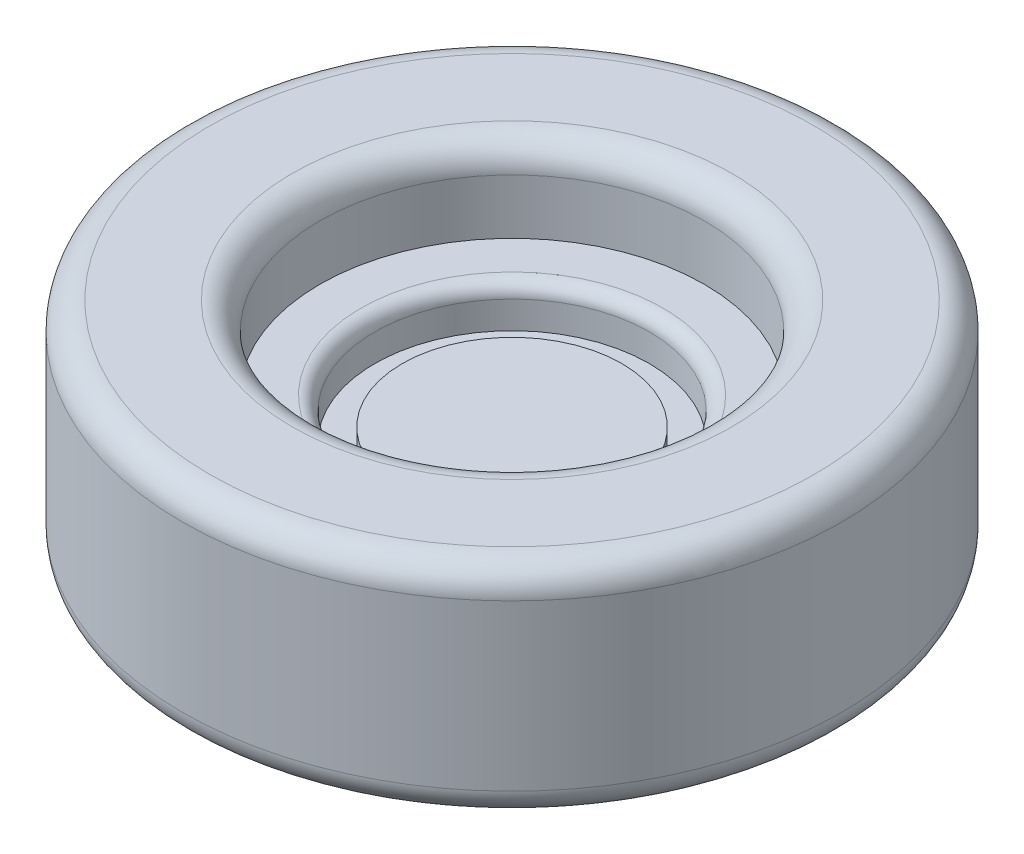
ISO-10303-21;
HEADER;
FILE_DESCRIPTION(('STEP AP214'),'2;1');
FILE_NAME('part.step','',(''),(''),'','','');
FILE_SCHEMA(('AUTOMOTIVE_DESIGN { 1 0 10303 214 1 1 1 1 }'));
ENDSEC;
DATA;
#1=APPLICATION_CONTEXT('core data for automotive mechanical design processes');
#2=APPLICATION_PROTOCOL_DEFINITION('international standard','automotive_design',2000,#1);
#3=PRODUCT_CONTEXT('',#1,'mechanical');
#4=PRODUCT('Part','Part','',(#3));
#5=PRODUCT_RELATED_PRODUCT_CATEGORY('part','',(#4));
#6=PRODUCT_DEFINITION_FORMATION('','',#4);
#7=PRODUCT_DEFINITION_CONTEXT('part definition',#1,'design');
#8=PRODUCT_DEFINITION('design','',#6,#7);
#9=PRODUCT_DEFINITION_SHAPE('','',#8);
#10=(LENGTH_UNIT() NAMED_UNIT(*) SI_UNIT(.MILLI.,.METRE.));
#11=(NAMED_UNIT(*) PLANE_ANGLE_UNIT() SI_UNIT($,.RADIAN.));
#12=(NAMED_UNIT(*) SI_UNIT($,.STERADIAN.) SOLID_ANGLE_UNIT());
#13=UNCERTAINTY_MEASURE_WITH_UNIT(LENGTH_MEASURE(1.E-05),#10,'distance_accuracy_value','');
#14=(GEOMETRIC_REPRESENTATION_CONTEXT(3) GLOBAL_UNCERTAINTY_ASSIGNED_CONTEXT((#13)) GLOBAL_UNIT_ASSIGNED_CONTEXT((#10,
#11,#12)) REPRESENTATION_CONTEXT('',''));
#15=CARTESIAN_POINT('',(0.,0.,0.));
#16=DIRECTION('',(0.,0.,1.));
#17=DIRECTION('',(1.,0.,0.));
#18=AXIS2_PLACEMENT_3D('',#15,#16,#17);
#19=CARTESIAN_POINT('',(0.,1.5,0.));
#20=DIRECTION('',(0.,1.,0.));
#21=DIRECTION('',(0.,0.,1.));
#22=AXIS2_PLACEMENT_3D('',#19,#20,#21);
#23=PLANE('',#22);
#24=DIRECTION('',(-1.,0.,0.));
#25=VECTOR('',#24,1.);
#26=CARTESIAN_POINT('',(-2.5,1.5,2.5));
#27=LINE('',#26,#25);
#28=CARTESIAN_POINT('',(2.5,1.5,2.5));
#29=VERTEX_POINT('',#28);
#30=CARTESIAN_POINT('',(-2.5,1.5,2.5));
#31=VERTEX_POINT('',#30);
#32=EDGE_CURVE('E89',#29,#31,#27,.T.);
#33=ORIENTED_EDGE('',*,*,#32,.F.);
#34=DIRECTION('',(0.,0.,1.));
#35=VECTOR('',#34,1.);
#36=CARTESIAN_POINT('',(2.5,1.5,2.5));
#37=LINE('',#36,#35);
#38=CARTESIAN_POINT('',(2.5,1.5,-2.5));
#39=VERTEX_POINT('',#38);
#40=EDGE_CURVE('E54',#39,#29,#37,.T.);
#41=ORIENTED_EDGE('',*,*,#40,.F.);
#42=DIRECTION('',(1.,0.,0.));
#43=VECTOR('',#42,1.);
#44=CARTESIAN_POINT('',(-2.5,1.5,-2.5));
#45=LINE('',#44,#43);
#46=CARTESIAN_POINT('',(-2.5,1.5,-2.5));
#47=VERTEX_POINT('',#46);
#48=EDGE_CURVE('E105',#47,#39,#45,.T.);
#49=ORIENTED_EDGE('',*,*,#48,.F.);
#50=DIRECTION('',(0.,0.,-1.));
#51=VECTOR('',#50,1.);
#52=CARTESIAN_POINT('',(-2.5,1.5,2.5));
#53=LINE('',#52,#51);
#54=EDGE_CURVE('E111',#31,#47,#53,.T.);
#55=ORIENTED_EDGE('',*,*,#54,.F.);
#56=EDGE_LOOP('',(#33,#41,#49,#55));
#57=FACE_BOUND('',#56,.T.);
#58=CARTESIAN_POINT('',(0.,1.5,0.));
#59=DIRECTION('',(0.,1.,0.));
#60=DIRECTION('',(0.,0.,1.));
#61=AXIS2_PLACEMENT_3D('',#58,#59,#60);
#62=CIRCLE('',#61,11.);
#63=CARTESIAN_POINT('',(0.,1.5,11.));
#64=VERTEX_POINT('',#63);
#65=EDGE_CURVE('E11',#64,#64,#62,.F.);
#66=ORIENTED_EDGE('',*,*,#65,.T.);
#67=EDGE_LOOP('',(#66));
#68=FACE_BOUND('',#67,.T.);
#69=ADVANCED_FACE('F39',(#57,#68),#23,.F.);
#70=CARTESIAN_POINT('',(0.,9.5,0.));
#71=DIRECTION('',(0.,-1.,0.));
#72=DIRECTION('',(0.,0.,-1.));
#73=AXIS2_PLACEMENT_3D('',#70,#71,#72);
#74=CYLINDRICAL_SURFACE('',#73,12.);
#75=CARTESIAN_POINT('',(0.,2.5,0.));
#76=DIRECTION('',(0.,1.,0.));
#77=DIRECTION('',(0.,0.,1.));
#78=AXIS2_PLACEMENT_3D('',#75,#76,#77);
#79=CIRCLE('',#78,12.);
#80=CARTESIAN_POINT('',(0.,2.5,12.));
#81=VERTEX_POINT('',#80);
#82=EDGE_CURVE('E47',#81,#81,#79,.T.);
#83=ORIENTED_EDGE('',*,*,#82,.T.);
#84=EDGE_LOOP('',(#83));
#85=FACE_BOUND('',#84,.T.);
#86=CARTESIAN_POINT('',(0.,8.5,0.));
#87=DIRECTION('',(0.,1.,0.));
#88=DIRECTION('',(0.,0.,1.));
#89=AXIS2_PLACEMENT_3D('',#86,#87,#88);
#90=CIRCLE('',#89,12.);
#91=CARTESIAN_POINT('',(0.,8.5,12.));
#92=VERTEX_POINT('',#91);
#93=EDGE_CURVE('E138',#92,#92,#90,.F.);
#94=ORIENTED_EDGE('',*,*,#93,.T.);
#95=EDGE_LOOP('',(#94));
#96=FACE_BOUND('',#95,.T.);
#97=ADVANCED_FACE('F149',(#85,#96),#74,.T.);
#98=CARTESIAN_POINT('',(0.,9.5,0.));
#99=DIRECTION('',(0.,1.,0.));
#100=DIRECTION('',(0.,0.,1.));
#101=AXIS2_PLACEMENT_3D('',#98,#99,#100);
#102=PLANE('',#101);
#103=CARTESIAN_POINT('',(0.,9.5,0.));
#104=DIRECTION('',(0.,1.,0.));
#105=DIRECTION('',(0.,0.,1.));
#106=AXIS2_PLACEMENT_3D('',#103,#104,#105);
#107=CIRCLE('',#106,8.);
#108=CARTESIAN_POINT('',(0.,9.5,8.));
#109=VERTEX_POINT('',#108);
#110=EDGE_CURVE('E135',#109,#109,#107,.F.);
#111=ORIENTED_EDGE('',*,*,#110,.T.);
#112=EDGE_LOOP('',(#111));
#113=FACE_BOUND('',#112,.T.);
#114=CARTESIAN_POINT('',(0.,9.5,0.));
#115=DIRECTION('',(0.,1.,0.));
#116=DIRECTION('',(0.,0.,1.));
#117=AXIS2_PLACEMENT_3D('',#114,#115,#116);
#118=CIRCLE('',#117,11.);
#119=CARTESIAN_POINT('',(0.,9.5,11.));
#120=VERTEX_POINT('',#119);
#121=EDGE_CURVE('E132',#120,#120,#118,.T.);
#122=ORIENTED_EDGE('',*,*,#121,.T.);
#123=EDGE_LOOP('',(#122));
#124=FACE_BOUND('',#123,.T.);
#125=ADVANCED_FACE('F171',(#113,#124),#102,.T.);
#126=CARTESIAN_POINT('',(0.,6.5,0.));
#127=DIRECTION('',(0.,1.,0.));
#128=DIRECTION('',(0.,0.,1.));
#129=AXIS2_PLACEMENT_3D('',#126,#127,#128);
#130=CYLINDRICAL_SURFACE('',#129,7.);
#131=CARTESIAN_POINT('',(0.,8.5,0.));
#132=DIRECTION('',(0.,1.,0.));
#133=DIRECTION('',(0.,0.,1.));
#134=AXIS2_PLACEMENT_3D('',#131,#132,#133);
#135=CIRCLE('',#134,7.);
#136=CARTESIAN_POINT('',(0.,8.5,7.));
#137=VERTEX_POINT('',#136);
#138=EDGE_CURVE('E129',#137,#137,#135,.T.);
#139=ORIENTED_EDGE('',*,*,#138,.T.);
#140=EDGE_LOOP('',(#139));
#141=FACE_BOUND('',#140,.T.);
#142=CARTESIAN_POINT('',(0.,6.5,0.));
#143=DIRECTION('',(0.,1.,0.));
#144=DIRECTION('',(0.,0.,1.));
#145=AXIS2_PLACEMENT_3D('',#142,#143,#144);
#146=CIRCLE('',#145,7.);
#147=CARTESIAN_POINT('',(0.,6.5,7.));
#148=VERTEX_POINT('',#147);
#149=EDGE_CURVE('E126',#148,#148,#146,.T.);
#150=ORIENTED_EDGE('',*,*,#149,.F.);
#151=EDGE_LOOP('',(#150));
#152=FACE_BOUND('',#151,.T.);
#153=ADVANCED_FACE('F191',(#141,#152),#130,.F.);
#154=CARTESIAN_POINT('',(0.,6.5,0.));
#155=DIRECTION('',(0.,1.,0.));
#156=DIRECTION('',(0.,0.,1.));
#157=AXIS2_PLACEMENT_3D('',#154,#155,#156);
#158=PLANE('',#157);
#159=CARTESIAN_POINT('',(0.,6.5,0.));
#160=DIRECTION('',(0.,1.,0.));
#161=DIRECTION('',(0.,0.,1.));
#162=AXIS2_PLACEMENT_3D('',#159,#160,#161);
#163=CIRCLE('',#162,5.5);
#164=CARTESIAN_POINT('',(0.,6.5,5.5));
#165=VERTEX_POINT('',#164);
#166=EDGE_CURVE('E144',#165,#165,#163,.F.);
#167=ORIENTED_EDGE('',*,*,#166,.T.);
#168=EDGE_LOOP('',(#167));
#169=FACE_BOUND('',#168,.T.);
#170=ORIENTED_EDGE('',*,*,#149,.T.);
#171=EDGE_LOOP('',(#170));
#172=FACE_BOUND('',#171,.T.);
#173=ADVANCED_FACE('F196',(#169,#172),#158,.T.);
#174=CARTESIAN_POINT('',(0.,5.,0.));
#175=DIRECTION('',(0.,1.,0.));
#176=DIRECTION('',(0.,0.,1.));
#177=AXIS2_PLACEMENT_3D('',#174,#175,#176);
#178=CYLINDRICAL_SURFACE('',#177,5.);
#179=CARTESIAN_POINT('',(0.,6.,0.));
#180=DIRECTION('',(0.,1.,0.));
#181=DIRECTION('',(0.,0.,1.));
#182=AXIS2_PLACEMENT_3D('',#179,#180,#181);
#183=CIRCLE('',#182,5.);
#184=CARTESIAN_POINT('',(0.,6.,5.));
#185=VERTEX_POINT('',#184);
#186=EDGE_CURVE('E141',#185,#185,#183,.T.);
#187=ORIENTED_EDGE('',*,*,#186,.T.);
#188=EDGE_LOOP('',(#187));
#189=FACE_BOUND('',#188,.T.);
#190=CARTESIAN_POINT('',(0.,5.,0.));
#191=DIRECTION('',(0.,1.,0.));
#192=DIRECTION('',(0.,0.,1.));
#193=AXIS2_PLACEMENT_3D('',#190,#191,#192);
#194=CIRCLE('',#193,5.);
#195=CARTESIAN_POINT('',(0.,5.,5.));
#196=VERTEX_POINT('',#195);
#197=EDGE_CURVE('E121',#196,#196,#194,.T.);
#198=ORIENTED_EDGE('',*,*,#197,.F.);
#199=EDGE_LOOP('',(#198));
#200=FACE_BOUND('',#199,.T.);
#201=ADVANCED_FACE('F205',(#189,#200),#178,.F.);
#202=CARTESIAN_POINT('',(0.,5.,0.));
#203=DIRECTION('',(0.,1.,0.));
#204=DIRECTION('',(0.,0.,1.));
#205=AXIS2_PLACEMENT_3D('',#202,#203,#204);
#206=PLANE('',#205);
#207=CARTESIAN_POINT('',(0.,5.,0.));
#208=DIRECTION('',(0.,1.,0.));
#209=DIRECTION('',(0.,0.,1.));
#210=AXIS2_PLACEMENT_3D('',#207,#208,#209);
#211=CIRCLE('',#210,4.);
#212=CARTESIAN_POINT('',(0.,5.,4.));
#213=VERTEX_POINT('',#212);
#214=EDGE_CURVE('E115',#213,#213,#211,.T.);
#215=ORIENTED_EDGE('',*,*,#214,.F.);
#216=EDGE_LOOP('',(#215));
#217=FACE_BOUND('',#216,.T.);
#218=ORIENTED_EDGE('',*,*,#197,.T.);
#219=EDGE_LOOP('',(#218));
#220=FACE_BOUND('',#219,.T.);
#221=ADVANCED_FACE('F211',(#217,#220),#206,.T.);
#222=CARTESIAN_POINT('',(0.,5.5,0.));
#223=DIRECTION('',(0.,-1.,0.));
#224=DIRECTION('',(0.,0.,-1.));
#225=AXIS2_PLACEMENT_3D('',#222,#223,#224);
#226=CYLINDRICAL_SURFACE('',#225,4.);
#227=CARTESIAN_POINT('',(0.,5.5,0.));
#228=DIRECTION('',(0.,1.,0.));
#229=DIRECTION('',(0.,0.,1.));
#230=AXIS2_PLACEMENT_3D('',#227,#228,#229);
#231=CIRCLE('',#230,4.);
#232=CARTESIAN_POINT('',(0.,5.5,4.));
#233=VERTEX_POINT('',#232);
#234=EDGE_CURVE('E118',#233,#233,#231,.T.);
#235=ORIENTED_EDGE('',*,*,#234,.F.);
#236=EDGE_LOOP('',(#235));
#237=FACE_BOUND('',#236,.T.);
#238=ORIENTED_EDGE('',*,*,#214,.T.);
#239=EDGE_LOOP('',(#238));
#240=FACE_BOUND('',#239,.T.);
#241=ADVANCED_FACE('F217',(#237,#240),#226,.T.);
#242=CARTESIAN_POINT('',(0.,5.5,0.));
#243=DIRECTION('',(0.,1.,0.));
#244=DIRECTION('',(0.,0.,1.));
#245=AXIS2_PLACEMENT_3D('',#242,#243,#244);
#246=PLANE('',#245);
#247=ORIENTED_EDGE('',*,*,#234,.T.);
#248=EDGE_LOOP('',(#247));
#249=FACE_BOUND('',#248,.T.);
#250=ADVANCED_FACE('F180',(#249),#246,.T.);
#251=CARTESIAN_POINT('',(0.,8.5,0.));
#252=DIRECTION('',(0.,1.,0.));
#253=DIRECTION('',(0.,0.,1.));
#254=AXIS2_PLACEMENT_3D('',#251,#252,#253);
#255=TOROIDAL_SURFACE('',#254,8.,1.);
#256=ORIENTED_EDGE('',*,*,#110,.F.);
#257=EDGE_LOOP('',(#256));
#258=FACE_BOUND('',#257,.T.);
#259=ORIENTED_EDGE('',*,*,#138,.F.);
#260=EDGE_LOOP('',(#259));
#261=FACE_BOUND('',#260,.T.);
#262=ADVANCED_FACE('F177',(#258,#261),#255,.T.);
#263=CARTESIAN_POINT('',(0.,8.5,0.));
#264=DIRECTION('',(0.,1.,0.));
#265=DIRECTION('',(0.,0.,1.));
#266=AXIS2_PLACEMENT_3D('',#263,#264,#265);
#267=TOROIDAL_SURFACE('',#266,11.,1.);
#268=ORIENTED_EDGE('',*,*,#93,.F.);
#269=EDGE_LOOP('',(#268));
#270=FACE_BOUND('',#269,.T.);
#271=ORIENTED_EDGE('',*,*,#121,.F.);
#272=EDGE_LOOP('',(#271));
#273=FACE_BOUND('',#272,.T.);
#274=ADVANCED_FACE('F162',(#270,#273),#267,.T.);
#275=CARTESIAN_POINT('',(0.,6.,0.));
#276=DIRECTION('',(0.,1.,0.));
#277=DIRECTION('',(0.,0.,1.));
#278=AXIS2_PLACEMENT_3D('',#275,#276,#277);
#279=TOROIDAL_SURFACE('',#278,5.5,0.5);
#280=ORIENTED_EDGE('',*,*,#166,.F.);
#281=EDGE_LOOP('',(#280));
#282=FACE_BOUND('',#281,.T.);
#283=ORIENTED_EDGE('',*,*,#186,.F.);
#284=EDGE_LOOP('',(#283));
#285=FACE_BOUND('',#284,.T.);
#286=ADVANCED_FACE('F154',(#282,#285),#279,.T.);
#287=CARTESIAN_POINT('',(0.,2.5,0.));
#288=DIRECTION('',(0.,1.,0.));
#289=DIRECTION('',(0.,0.,1.));
#290=AXIS2_PLACEMENT_3D('',#287,#288,#289);
#291=TOROIDAL_SURFACE('',#290,11.,1.);
#292=ORIENTED_EDGE('',*,*,#65,.F.);
#293=EDGE_LOOP('',(#292));
#294=FACE_BOUND('',#293,.T.);
#295=ORIENTED_EDGE('',*,*,#82,.F.);
#296=EDGE_LOOP('',(#295));
#297=FACE_BOUND('',#296,.T.);
#298=ADVANCED_FACE('F41',(#294,#297),#291,.T.);
#299=CARTESIAN_POINT('',(2.5,3.,2.5));
#300=DIRECTION('',(1.,0.,0.));
#301=DIRECTION('',(0.,0.,-1.));
#302=AXIS2_PLACEMENT_3D('',#299,#300,#301);
#303=PLANE('',#302);
#304=ORIENTED_EDGE('',*,*,#40,.T.);
#305=DIRECTION('',(0.,-1.,0.));
#306=VECTOR('',#305,1.);
#307=CARTESIAN_POINT('',(2.5,3.,2.5));
#308=LINE('',#307,#306);
#309=CARTESIAN_POINT('',(2.5,3.,2.5));
#310=VERTEX_POINT('',#309);
#311=EDGE_CURVE('E77',#310,#29,#308,.T.);
#312=ORIENTED_EDGE('',*,*,#311,.F.);
#313=DIRECTION('',(0.,0.,1.));
#314=VECTOR('',#313,1.);
#315=CARTESIAN_POINT('',(2.5,3.,2.5));
#316=LINE('',#315,#314);
#317=CARTESIAN_POINT('',(2.5,3.,-2.5));
#318=VERTEX_POINT('',#317);
#319=EDGE_CURVE('E103',#318,#310,#316,.T.);
#320=ORIENTED_EDGE('',*,*,#319,.F.);
#321=DIRECTION('',(0.,-1.,0.));
#322=VECTOR('',#321,1.);
#323=CARTESIAN_POINT('',(2.5,3.,-2.5));
#324=LINE('',#323,#322);
#325=EDGE_CURVE('E62',#318,#39,#324,.T.);
#326=ORIENTED_EDGE('',*,*,#325,.T.);
#327=EDGE_LOOP('',(#304,#312,#320,#326));
#328=FACE_BOUND('',#327,.T.);
#329=ADVANCED_FACE('F153',(#328),#303,.F.);
#330=CARTESIAN_POINT('',(-2.5,3.,-2.5));
#331=DIRECTION('',(0.,0.,-1.));
#332=DIRECTION('',(-1.,0.,0.));
#333=AXIS2_PLACEMENT_3D('',#330,#331,#332);
#334=PLANE('',#333);
#335=ORIENTED_EDGE('',*,*,#48,.T.);
#336=ORIENTED_EDGE('',*,*,#325,.F.);
#337=DIRECTION('',(1.,0.,0.));
#338=VECTOR('',#337,1.);
#339=CARTESIAN_POINT('',(-2.5,3.,-2.5));
#340=LINE('',#339,#338);
#341=CARTESIAN_POINT('',(-2.5,3.,-2.5));
#342=VERTEX_POINT('',#341);
#343=EDGE_CURVE('E100',#342,#318,#340,.T.);
#344=ORIENTED_EDGE('',*,*,#343,.F.);
#345=DIRECTION('',(0.,-1.,0.));
#346=VECTOR('',#345,1.);
#347=CARTESIAN_POINT('',(-2.5,3.,-2.5));
#348=LINE('',#347,#346);
#349=EDGE_CURVE('E93',#342,#47,#348,.T.);
#350=ORIENTED_EDGE('',*,*,#349,.T.);
#351=EDGE_LOOP('',(#335,#336,#344,#350));
#352=FACE_BOUND('',#351,.T.);
#353=ADVANCED_FACE('F160',(#352),#334,.F.);
#354=CARTESIAN_POINT('',(-2.5,3.,2.5));
#355=DIRECTION('',(-1.,0.,0.));
#356=DIRECTION('',(0.,0.,1.));
#357=AXIS2_PLACEMENT_3D('',#354,#355,#356);
#358=PLANE('',#357);
#359=ORIENTED_EDGE('',*,*,#54,.T.);
#360=ORIENTED_EDGE('',*,*,#349,.F.);
#361=DIRECTION('',(0.,0.,-1.));
#362=VECTOR('',#361,1.);
#363=CARTESIAN_POINT('',(-2.5,3.,2.5));
#364=LINE('',#363,#362);
#365=CARTESIAN_POINT('',(-2.5,3.,2.5));
#366=VERTEX_POINT('',#365);
#367=EDGE_CURVE('E96',#366,#342,#364,.T.);
#368=ORIENTED_EDGE('',*,*,#367,.F.);
#369=DIRECTION('',(0.,-1.,0.));
#370=VECTOR('',#369,1.);
#371=CARTESIAN_POINT('',(-2.5,3.,2.5));
#372=LINE('',#371,#370);
#373=EDGE_CURVE('E82',#366,#31,#372,.T.);
#374=ORIENTED_EDGE('',*,*,#373,.T.);
#375=EDGE_LOOP('',(#359,#360,#368,#374));
#376=FACE_BOUND('',#375,.T.);
#377=ADVANCED_FACE('F97',(#376),#358,.F.);
#378=CARTESIAN_POINT('',(-2.5,3.,2.5));
#379=DIRECTION('',(0.,0.,1.));
#380=DIRECTION('',(1.,0.,0.));
#381=AXIS2_PLACEMENT_3D('',#378,#379,#380);
#382=PLANE('',#381);
#383=ORIENTED_EDGE('',*,*,#32,.T.);
#384=ORIENTED_EDGE('',*,*,#373,.F.);
#385=DIRECTION('',(-1.,0.,0.));
#386=VECTOR('',#385,1.);
#387=CARTESIAN_POINT('',(-2.5,3.,2.5));
#388=LINE('',#387,#386);
#389=EDGE_CURVE('E86',#310,#366,#388,.T.);
#390=ORIENTED_EDGE('',*,*,#389,.F.);
#391=ORIENTED_EDGE('',*,*,#311,.T.);
#392=EDGE_LOOP('',(#383,#384,#390,#391));
#393=FACE_BOUND('',#392,.T.);
#394=ADVANCED_FACE('F84',(#393),#382,.F.);
#395=CARTESIAN_POINT('',(0.,3.,0.));
#396=DIRECTION('',(0.,-1.,0.));
#397=DIRECTION('',(0.,0.,-1.));
#398=AXIS2_PLACEMENT_3D('',#395,#396,#397);
#399=PLANE('',#398);
#400=ORIENTED_EDGE('',*,*,#319,.T.);
#401=ORIENTED_EDGE('',*,*,#389,.T.);
#402=ORIENTED_EDGE('',*,*,#367,.T.);
#403=ORIENTED_EDGE('',*,*,#343,.T.);
#404=EDGE_LOOP('',(#400,#401,#402,#403));
#405=FACE_BOUND('',#404,.T.);
#406=ADVANCED_FACE('F102',(#405),#399,.T.);
#407=CLOSED_SHELL('',(#69,#97,#125,#153,#173,#201,#221,#241,#250,#262,#274,#286,#298,#329,#353,
#377,#394,#406));
#408=MANIFOLD_SOLID_BREP('B2',#407);
#409=ADVANCED_BREP_SHAPE_REPRESENTATION('',(#18,#408),#14);
#410=SHAPE_DEFINITION_REPRESENTATION(#9,#409);
ENDSEC;
END-ISO-10303-21;
